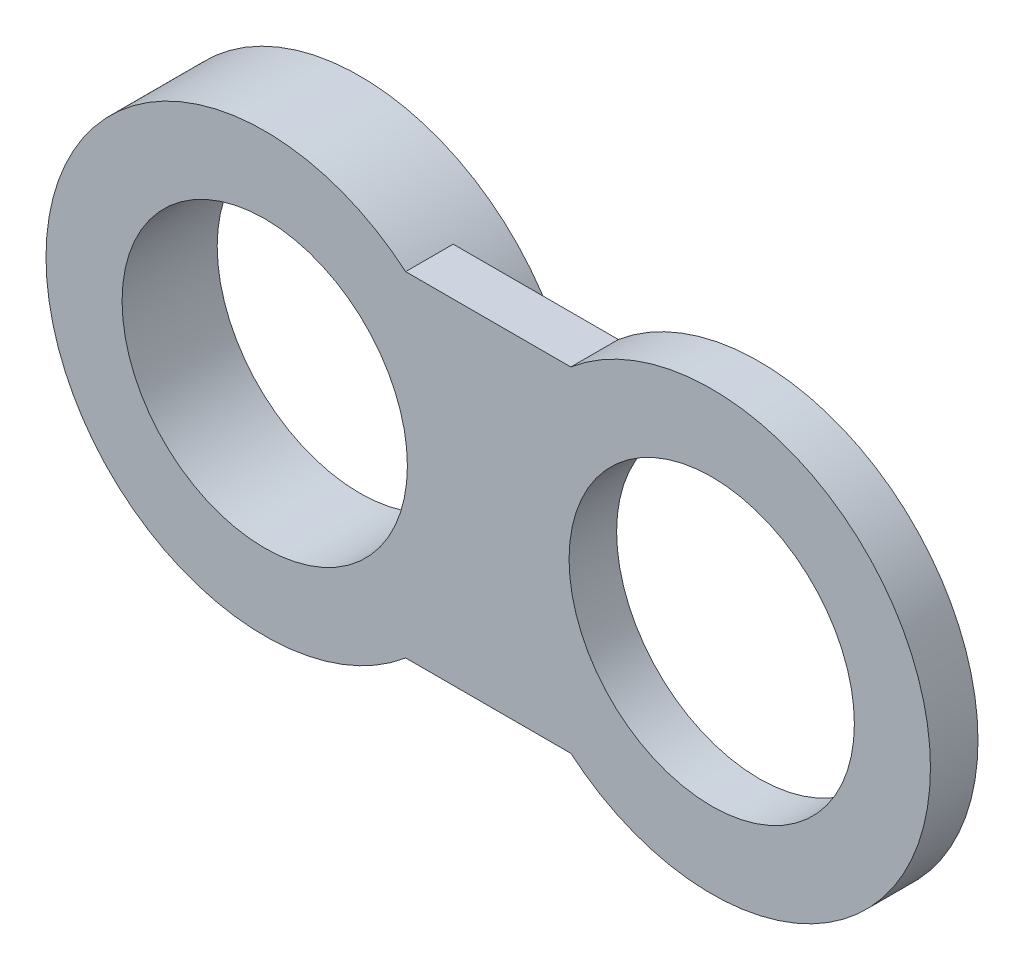
ISO-10303-21;
HEADER;
FILE_DESCRIPTION(('STEP AP214'),'2;1');
FILE_NAME('part.step','',(''),(''),'','','');
FILE_SCHEMA(('AUTOMOTIVE_DESIGN { 1 0 10303 214 1 1 1 1 }'));
ENDSEC;
DATA;
#1=APPLICATION_CONTEXT('core data for automotive mechanical design processes');
#2=APPLICATION_PROTOCOL_DEFINITION('international standard','automotive_design',2000,#1);
#3=PRODUCT_CONTEXT('',#1,'mechanical');
#4=PRODUCT('Part','Part','',(#3));
#5=PRODUCT_RELATED_PRODUCT_CATEGORY('part','',(#4));
#6=PRODUCT_DEFINITION_FORMATION('','',#4);
#7=PRODUCT_DEFINITION_CONTEXT('part definition',#1,'design');
#8=PRODUCT_DEFINITION('design','',#6,#7);
#9=PRODUCT_DEFINITION_SHAPE('','',#8);
#10=(LENGTH_UNIT() NAMED_UNIT(*) SI_UNIT(.MILLI.,.METRE.));
#11=(NAMED_UNIT(*) PLANE_ANGLE_UNIT() SI_UNIT($,.RADIAN.));
#12=(NAMED_UNIT(*) SI_UNIT($,.STERADIAN.) SOLID_ANGLE_UNIT());
#13=UNCERTAINTY_MEASURE_WITH_UNIT(LENGTH_MEASURE(1.E-05),#10,'distance_accuracy_value','');
#14=(GEOMETRIC_REPRESENTATION_CONTEXT(3) GLOBAL_UNCERTAINTY_ASSIGNED_CONTEXT((#13)) GLOBAL_UNIT_ASSIGNED_CONTEXT((#10,
#11,#12)) REPRESENTATION_CONTEXT('',''));
#15=CARTESIAN_POINT('',(0.,0.,0.));
#16=DIRECTION('',(0.,0.,1.));
#17=DIRECTION('',(1.,0.,0.));
#18=AXIS2_PLACEMENT_3D('',#15,#16,#17);
#19=CARTESIAN_POINT('',(0.,175.909198011507,-25.));
#20=DIRECTION('',(0.,-1.,0.));
#21=DIRECTION('',(0.,0.,-1.));
#22=AXIS2_PLACEMENT_3D('',#19,#20,#21);
#23=PLANE('',#22);
#24=DIRECTION('',(0.,0.,1.));
#25=VECTOR('',#24,1.);
#26=CARTESIAN_POINT('',(-101.8245835,175.909198011507,-25.));
#27=LINE('',#26,#25);
#28=CARTESIAN_POINT('',(-101.8245835,175.909198011507,-25.));
#29=VERTEX_POINT('',#28);
#30=CARTESIAN_POINT('',(-101.8245835,175.909198011507,25.));
#31=VERTEX_POINT('',#30);
#32=EDGE_CURVE('E91',#29,#31,#27,.T.);
#33=ORIENTED_EDGE('',*,*,#32,.T.);
#34=DIRECTION('',(1.,0.,0.));
#35=VECTOR('',#34,1.);
#36=CARTESIAN_POINT('',(0.,175.909198011507,25.));
#37=LINE('',#36,#35);
#38=CARTESIAN_POINT('',(71.8245835,175.909198011507,25.));
#39=VERTEX_POINT('',#38);
#40=EDGE_CURVE('E136',#31,#39,#37,.T.);
#41=ORIENTED_EDGE('',*,*,#40,.T.);
#42=DIRECTION('',(0.,0.,1.));
#43=VECTOR('',#42,1.);
#44=CARTESIAN_POINT('',(71.8245835,175.909198011507,-25.));
#45=LINE('',#44,#43);
#46=CARTESIAN_POINT('',(71.8245835,175.909198011507,-25.));
#47=VERTEX_POINT('',#46);
#48=EDGE_CURVE('E51',#47,#39,#45,.T.);
#49=ORIENTED_EDGE('',*,*,#48,.F.);
#50=DIRECTION('',(1.,0.,0.));
#51=VECTOR('',#50,1.);
#52=CARTESIAN_POINT('',(0.,175.909198011507,-25.));
#53=LINE('',#52,#51);
#54=EDGE_CURVE('E57',#29,#47,#53,.T.);
#55=ORIENTED_EDGE('',*,*,#54,.F.);
#56=EDGE_LOOP('',(#33,#41,#49,#55));
#57=FACE_BOUND('',#56,.T.);
#58=ADVANCED_FACE('F43',(#57),#23,.F.);
#59=CARTESIAN_POINT('',(220.,0.,-25.));
#60=DIRECTION('',(0.,0.,1.));
#61=DIRECTION('',(1.,0.,0.));
#62=AXIS2_PLACEMENT_3D('',#59,#60,#61);
#63=CYLINDRICAL_SURFACE('',#62,230.);
#64=ORIENTED_EDGE('',*,*,#48,.T.);
#65=CARTESIAN_POINT('',(220.,0.,25.));
#66=DIRECTION('',(0.,0.,1.));
#67=DIRECTION('',(1.,0.,0.));
#68=AXIS2_PLACEMENT_3D('',#65,#66,#67);
#69=CIRCLE('',#68,230.);
#70=CARTESIAN_POINT('',(71.8245835,-175.909198011507,25.));
#71=VERTEX_POINT('',#70);
#72=EDGE_CURVE('E127',#71,#39,#69,.T.);
#73=ORIENTED_EDGE('',*,*,#72,.F.);
#74=DIRECTION('',(0.,0.,1.));
#75=VECTOR('',#74,1.);
#76=CARTESIAN_POINT('',(71.8245835,-175.909198011507,-25.));
#77=LINE('',#76,#75);
#78=CARTESIAN_POINT('',(71.8245835,-175.909198011507,-25.));
#79=VERTEX_POINT('',#78);
#80=EDGE_CURVE('E65',#79,#71,#77,.T.);
#81=ORIENTED_EDGE('',*,*,#80,.F.);
#82=CARTESIAN_POINT('',(220.,0.,-25.));
#83=DIRECTION('',(0.,0.,1.));
#84=DIRECTION('',(1.,0.,0.));
#85=AXIS2_PLACEMENT_3D('',#82,#83,#84);
#86=CIRCLE('',#85,230.);
#87=EDGE_CURVE('E95',#79,#47,#86,.T.);
#88=ORIENTED_EDGE('',*,*,#87,.T.);
#89=EDGE_LOOP('',(#64,#73,#81,#88));
#90=FACE_BOUND('',#89,.T.);
#91=ADVANCED_FACE('F161',(#90),#63,.T.);
#92=CARTESIAN_POINT('',(0.,-175.909198011507,-25.));
#93=DIRECTION('',(0.,1.,0.));
#94=DIRECTION('',(-1.,0.,0.));
#95=AXIS2_PLACEMENT_3D('',#92,#93,#94);
#96=PLANE('',#95);
#97=ORIENTED_EDGE('',*,*,#80,.T.);
#98=DIRECTION('',(-1.,0.,0.));
#99=VECTOR('',#98,1.);
#100=CARTESIAN_POINT('',(0.,-175.909198011507,25.));
#101=LINE('',#100,#99);
#102=CARTESIAN_POINT('',(-101.8245835,-175.909198011507,25.));
#103=VERTEX_POINT('',#102);
#104=EDGE_CURVE('E102',#71,#103,#101,.T.);
#105=ORIENTED_EDGE('',*,*,#104,.T.);
#106=DIRECTION('',(0.,0.,1.));
#107=VECTOR('',#106,1.);
#108=CARTESIAN_POINT('',(-101.8245835,-175.909198011507,-25.));
#109=LINE('',#108,#107);
#110=CARTESIAN_POINT('',(-101.8245835,-175.909198011507,-25.));
#111=VERTEX_POINT('',#110);
#112=EDGE_CURVE('E89',#111,#103,#109,.T.);
#113=ORIENTED_EDGE('',*,*,#112,.F.);
#114=DIRECTION('',(-1.,0.,0.));
#115=VECTOR('',#114,1.);
#116=CARTESIAN_POINT('',(0.,-175.909198011507,-25.));
#117=LINE('',#116,#115);
#118=EDGE_CURVE('E92',#79,#111,#117,.T.);
#119=ORIENTED_EDGE('',*,*,#118,.F.);
#120=EDGE_LOOP('',(#97,#105,#113,#119));
#121=FACE_BOUND('',#120,.T.);
#122=ADVANCED_FACE('F100',(#121),#96,.F.);
#123=CARTESIAN_POINT('',(-250.,0.,-25.));
#124=DIRECTION('',(0.,0.,1.));
#125=DIRECTION('',(1.,0.,0.));
#126=AXIS2_PLACEMENT_3D('',#123,#124,#125);
#127=CYLINDRICAL_SURFACE('',#126,150.);
#128=CARTESIAN_POINT('',(-250.,0.,25.));
#129=DIRECTION('',(0.,0.,1.));
#130=DIRECTION('',(1.,0.,0.));
#131=AXIS2_PLACEMENT_3D('',#128,#129,#130);
#132=CIRCLE('',#131,150.);
#133=CARTESIAN_POINT('',(-99.9999999999999,0.,25.));
#134=VERTEX_POINT('',#133);
#135=EDGE_CURVE('E123',#134,#134,#132,.T.);
#136=ORIENTED_EDGE('',*,*,#135,.T.);
#137=EDGE_LOOP('',(#136));
#138=FACE_BOUND('',#137,.T.);
#139=CARTESIAN_POINT('',(-250.,0.,-75.));
#140=DIRECTION('',(0.,0.,1.));
#141=DIRECTION('',(1.,0.,0.));
#142=AXIS2_PLACEMENT_3D('',#139,#140,#141);
#143=CIRCLE('',#142,150.);
#144=CARTESIAN_POINT('',(-99.9999999999999,0.,-75.));
#145=VERTEX_POINT('',#144);
#146=EDGE_CURVE('E144',#145,#145,#143,.T.);
#147=ORIENTED_EDGE('',*,*,#146,.F.);
#148=EDGE_LOOP('',(#147));
#149=FACE_BOUND('',#148,.T.);
#150=ADVANCED_FACE('F152',(#138,#149),#127,.F.);
#151=CARTESIAN_POINT('',(-250.,0.,-25.));
#152=DIRECTION('',(0.,0.,1.));
#153=DIRECTION('',(1.,0.,0.));
#154=AXIS2_PLACEMENT_3D('',#151,#152,#153);
#155=CYLINDRICAL_SURFACE('',#154,230.);
#156=CARTESIAN_POINT('',(-250.,0.,25.));
#157=DIRECTION('',(0.,0.,1.));
#158=DIRECTION('',(1.,0.,0.));
#159=AXIS2_PLACEMENT_3D('',#156,#157,#158);
#160=CIRCLE('',#159,230.);
#161=EDGE_CURVE('E133',#31,#103,#160,.T.);
#162=ORIENTED_EDGE('',*,*,#161,.F.);
#163=ORIENTED_EDGE('',*,*,#32,.F.);
#164=CARTESIAN_POINT('',(-250.,0.,-25.));
#165=DIRECTION('',(0.,0.,1.));
#166=DIRECTION('',(1.,0.,0.));
#167=AXIS2_PLACEMENT_3D('',#164,#165,#166);
#168=CIRCLE('',#167,230.);
#169=EDGE_CURVE('E11',#111,#29,#168,.T.);
#170=ORIENTED_EDGE('',*,*,#169,.F.);
#171=ORIENTED_EDGE('',*,*,#112,.T.);
#172=EDGE_LOOP('',(#162,#163,#170,#171));
#173=FACE_BOUND('',#172,.T.);
#174=CARTESIAN_POINT('',(-250.,0.,-75.));
#175=DIRECTION('',(0.,0.,1.));
#176=DIRECTION('',(1.,0.,0.));
#177=AXIS2_PLACEMENT_3D('',#174,#175,#176);
#178=CIRCLE('',#177,230.);
#179=CARTESIAN_POINT('',(-20.,0.,-75.));
#180=VERTEX_POINT('',#179);
#181=EDGE_CURVE('E140',#180,#180,#178,.T.);
#182=ORIENTED_EDGE('',*,*,#181,.T.);
#183=EDGE_LOOP('',(#182));
#184=FACE_BOUND('',#183,.T.);
#185=ADVANCED_FACE('F86',(#173,#184),#155,.T.);
#186=CARTESIAN_POINT('',(220.,0.,-25.));
#187=DIRECTION('',(0.,0.,1.));
#188=DIRECTION('',(1.,0.,0.));
#189=AXIS2_PLACEMENT_3D('',#186,#187,#188);
#190=CYLINDRICAL_SURFACE('',#189,150.);
#191=CARTESIAN_POINT('',(220.,0.,-25.));
#192=DIRECTION('',(0.,0.,1.));
#193=DIRECTION('',(1.,0.,0.));
#194=AXIS2_PLACEMENT_3D('',#191,#192,#193);
#195=CIRCLE('',#194,150.);
#196=CARTESIAN_POINT('',(370.,0.,-25.));
#197=VERTEX_POINT('',#196);
#198=EDGE_CURVE('E108',#197,#197,#195,.T.);
#199=ORIENTED_EDGE('',*,*,#198,.F.);
#200=EDGE_LOOP('',(#199));
#201=FACE_BOUND('',#200,.T.);
#202=CARTESIAN_POINT('',(220.,0.,25.));
#203=DIRECTION('',(0.,0.,1.));
#204=DIRECTION('',(1.,0.,0.));
#205=AXIS2_PLACEMENT_3D('',#202,#203,#204);
#206=CIRCLE('',#205,150.);
#207=CARTESIAN_POINT('',(370.,0.,25.));
#208=VERTEX_POINT('',#207);
#209=EDGE_CURVE('E119',#208,#208,#206,.T.);
#210=ORIENTED_EDGE('',*,*,#209,.T.);
#211=EDGE_LOOP('',(#210));
#212=FACE_BOUND('',#211,.T.);
#213=ADVANCED_FACE('F160',(#201,#212),#190,.F.);
#214=CARTESIAN_POINT('',(0.,0.,-25.));
#215=DIRECTION('',(0.,0.,1.));
#216=DIRECTION('',(1.,0.,0.));
#217=AXIS2_PLACEMENT_3D('',#214,#215,#216);
#218=PLANE('',#217);
#219=ORIENTED_EDGE('',*,*,#118,.T.);
#220=ORIENTED_EDGE('',*,*,#169,.T.);
#221=ORIENTED_EDGE('',*,*,#54,.T.);
#222=ORIENTED_EDGE('',*,*,#87,.F.);
#223=EDGE_LOOP('',(#219,#220,#221,#222));
#224=FACE_BOUND('',#223,.T.);
#225=ORIENTED_EDGE('',*,*,#198,.T.);
#226=EDGE_LOOP('',(#225));
#227=FACE_BOUND('',#226,.T.);
#228=ADVANCED_FACE('F93',(#224,#227),#218,.F.);
#229=CARTESIAN_POINT('',(0.,0.,25.));
#230=DIRECTION('',(0.,0.,1.));
#231=DIRECTION('',(1.,0.,0.));
#232=AXIS2_PLACEMENT_3D('',#229,#230,#231);
#233=PLANE('',#232);
#234=ORIENTED_EDGE('',*,*,#40,.F.);
#235=ORIENTED_EDGE('',*,*,#161,.T.);
#236=ORIENTED_EDGE('',*,*,#104,.F.);
#237=ORIENTED_EDGE('',*,*,#72,.T.);
#238=EDGE_LOOP('',(#234,#235,#236,#237));
#239=FACE_BOUND('',#238,.T.);
#240=ORIENTED_EDGE('',*,*,#135,.F.);
#241=EDGE_LOOP('',(#240));
#242=FACE_BOUND('',#241,.T.);
#243=ORIENTED_EDGE('',*,*,#209,.F.);
#244=EDGE_LOOP('',(#243));
#245=FACE_BOUND('',#244,.T.);
#246=ADVANCED_FACE('F172',(#239,#242,#245),#233,.T.);
#247=CARTESIAN_POINT('',(0.,0.,-75.));
#248=DIRECTION('',(0.,0.,1.));
#249=DIRECTION('',(1.,0.,0.));
#250=AXIS2_PLACEMENT_3D('',#247,#248,#249);
#251=PLANE('',#250);
#252=ORIENTED_EDGE('',*,*,#146,.T.);
#253=EDGE_LOOP('',(#252));
#254=FACE_BOUND('',#253,.T.);
#255=ORIENTED_EDGE('',*,*,#181,.F.);
#256=EDGE_LOOP('',(#255));
#257=FACE_BOUND('',#256,.T.);
#258=ADVANCED_FACE('F149',(#254,#257),#251,.F.);
#259=CLOSED_SHELL('',(#58,#91,#122,#150,#185,#213,#228,#246,#258));
#260=MANIFOLD_SOLID_BREP('B2',#259);
#261=ADVANCED_BREP_SHAPE_REPRESENTATION('',(#18,#260),#14);
#262=SHAPE_DEFINITION_REPRESENTATION(#9,#261);
ENDSEC;
END-ISO-10303-21;
